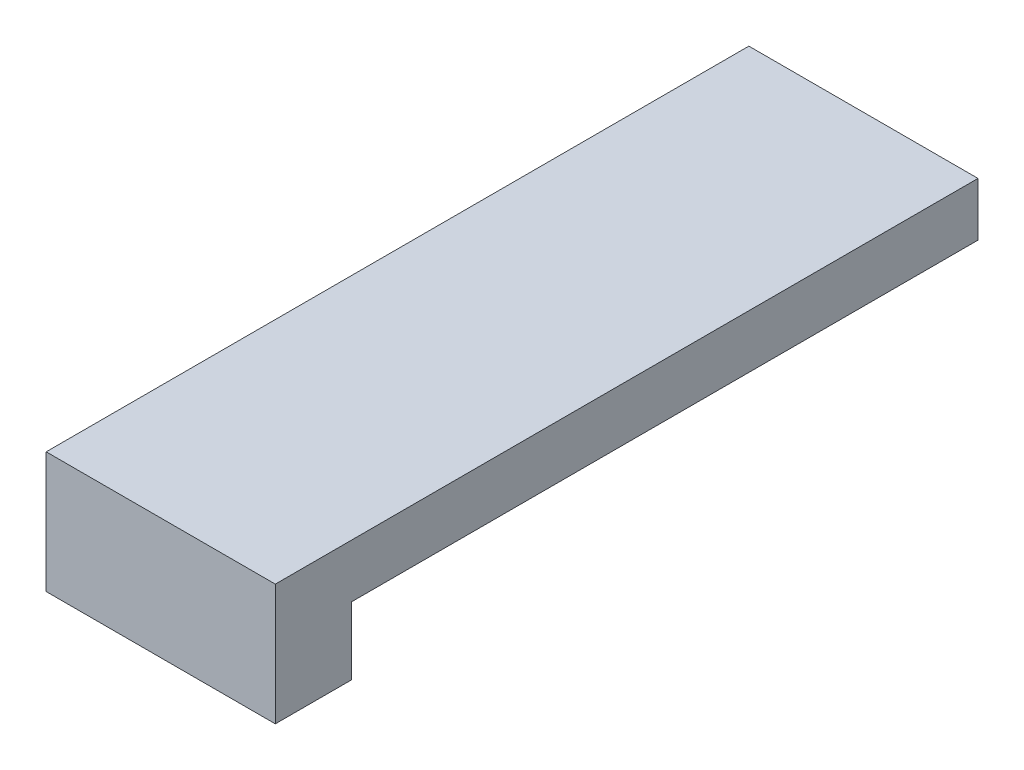
ISO-10303-21;
HEADER;
FILE_DESCRIPTION(('STEP AP214'),'2;1');
FILE_NAME('part.step','',(''),(''),'','','');
FILE_SCHEMA(('AUTOMOTIVE_DESIGN { 1 0 10303 214 1 1 1 1 }'));
ENDSEC;
DATA;
#1=APPLICATION_CONTEXT('core data for automotive mechanical design processes');
#2=APPLICATION_PROTOCOL_DEFINITION('international standard','automotive_design',2000,#1);
#3=PRODUCT_CONTEXT('',#1,'mechanical');
#4=PRODUCT('Part','Part','',(#3));
#5=PRODUCT_RELATED_PRODUCT_CATEGORY('part','',(#4));
#6=PRODUCT_DEFINITION_FORMATION('','',#4);
#7=PRODUCT_DEFINITION_CONTEXT('part definition',#1,'design');
#8=PRODUCT_DEFINITION('design','',#6,#7);
#9=PRODUCT_DEFINITION_SHAPE('','',#8);
#10=(LENGTH_UNIT() NAMED_UNIT(*) SI_UNIT(.MILLI.,.METRE.));
#11=(NAMED_UNIT(*) PLANE_ANGLE_UNIT() SI_UNIT($,.RADIAN.));
#12=(NAMED_UNIT(*) SI_UNIT($,.STERADIAN.) SOLID_ANGLE_UNIT());
#13=UNCERTAINTY_MEASURE_WITH_UNIT(LENGTH_MEASURE(1.E-05),#10,'distance_accuracy_value','');
#14=(GEOMETRIC_REPRESENTATION_CONTEXT(3) GLOBAL_UNCERTAINTY_ASSIGNED_CONTEXT((#13)) GLOBAL_UNIT_ASSIGNED_CONTEXT((#10,
#11,#12)) REPRESENTATION_CONTEXT('',''));
#15=CARTESIAN_POINT('',(0.,0.,0.));
#16=DIRECTION('',(0.,0.,1.));
#17=DIRECTION('',(1.,0.,0.));
#18=AXIS2_PLACEMENT_3D('',#15,#16,#17);
#19=CARTESIAN_POINT('',(-31.0895623366846,21.553225109489,41.));
#20=DIRECTION('',(1.,0.,0.));
#21=DIRECTION('',(0.,0.,-1.));
#22=AXIS2_PLACEMENT_3D('',#19,#20,#21);
#23=PLANE('',#22);
#24=DIRECTION('',(0.,-1.,0.));
#25=VECTOR('',#24,1.);
#26=CARTESIAN_POINT('',(-31.0895623366846,21.553225109489,0.));
#27=LINE('',#26,#25);
#28=CARTESIAN_POINT('',(-31.0895623366846,25.053225109489,0.));
#29=VERTEX_POINT('',#28);
#30=CARTESIAN_POINT('',(-31.0895623366846,21.553225109489,0.));
#31=VERTEX_POINT('',#30);
#32=EDGE_CURVE('E84',#29,#31,#27,.T.);
#33=ORIENTED_EDGE('',*,*,#32,.T.);
#34=DIRECTION('',(0.,0.,-1.));
#35=VECTOR('',#34,1.);
#36=CARTESIAN_POINT('',(-31.0895623366846,21.553225109489,41.));
#37=LINE('',#36,#35);
#38=CARTESIAN_POINT('',(-31.0895623366846,21.553225109489,41.));
#39=VERTEX_POINT('',#38);
#40=EDGE_CURVE('E11',#39,#31,#37,.T.);
#41=ORIENTED_EDGE('',*,*,#40,.F.);
#42=DIRECTION('',(0.,-1.,0.));
#43=VECTOR('',#42,1.);
#44=CARTESIAN_POINT('',(-31.0895623366846,21.553225109489,41.));
#45=LINE('',#44,#43);
#46=CARTESIAN_POINT('',(-31.0895623366846,25.053225109489,41.));
#47=VERTEX_POINT('',#46);
#48=EDGE_CURVE('E79',#47,#39,#45,.T.);
#49=ORIENTED_EDGE('',*,*,#48,.F.);
#50=DIRECTION('',(0.,0.,-1.));
#51=VECTOR('',#50,1.);
#52=CARTESIAN_POINT('',(-31.0895623366846,25.053225109489,41.));
#53=LINE('',#52,#51);
#54=EDGE_CURVE('E52',#47,#29,#53,.T.);
#55=ORIENTED_EDGE('',*,*,#54,.T.);
#56=EDGE_LOOP('',(#33,#41,#49,#55));
#57=FACE_BOUND('',#56,.T.);
#58=ADVANCED_FACE('F33',(#57),#23,.F.);
#59=CARTESIAN_POINT('',(-16.0895623366846,21.553225109489,41.));
#60=DIRECTION('',(0.,1.,0.));
#61=DIRECTION('',(0.,0.,1.));
#62=AXIS2_PLACEMENT_3D('',#59,#60,#61);
#63=PLANE('',#62);
#64=DIRECTION('',(1.,0.,0.));
#65=VECTOR('',#64,1.);
#66=CARTESIAN_POINT('',(-16.0895623366846,21.553225109489,0.));
#67=LINE('',#66,#65);
#68=CARTESIAN_POINT('',(-16.0895623366846,21.553225109489,0.));
#69=VERTEX_POINT('',#68);
#70=EDGE_CURVE('E89',#31,#69,#67,.T.);
#71=ORIENTED_EDGE('',*,*,#70,.T.);
#72=DIRECTION('',(0.,0.,-1.));
#73=VECTOR('',#72,1.);
#74=CARTESIAN_POINT('',(-16.0895623366846,21.553225109489,41.));
#75=LINE('',#74,#73);
#76=CARTESIAN_POINT('',(-16.0895623366846,21.553225109489,41.));
#77=VERTEX_POINT('',#76);
#78=EDGE_CURVE('E43',#77,#69,#75,.T.);
#79=ORIENTED_EDGE('',*,*,#78,.F.);
#80=DIRECTION('',(1.,0.,0.));
#81=VECTOR('',#80,1.);
#82=CARTESIAN_POINT('',(-16.0895623366846,21.553225109489,41.));
#83=LINE('',#82,#81);
#84=EDGE_CURVE('E36',#39,#77,#83,.T.);
#85=ORIENTED_EDGE('',*,*,#84,.F.);
#86=ORIENTED_EDGE('',*,*,#40,.T.);
#87=EDGE_LOOP('',(#71,#79,#85,#86));
#88=FACE_BOUND('',#87,.T.);
#89=ADVANCED_FACE('F109',(#88),#63,.F.);
#90=CARTESIAN_POINT('',(-16.0895623366846,25.053225109489,41.));
#91=DIRECTION('',(-1.,0.,0.));
#92=DIRECTION('',(0.,0.,1.));
#93=AXIS2_PLACEMENT_3D('',#90,#91,#92);
#94=PLANE('',#93);
#95=DIRECTION('',(0.,1.,0.));
#96=VECTOR('',#95,1.);
#97=CARTESIAN_POINT('',(-16.0895623366846,25.053225109489,0.));
#98=LINE('',#97,#96);
#99=CARTESIAN_POINT('',(-16.0895623366846,25.053225109489,0.));
#100=VERTEX_POINT('',#99);
#101=EDGE_CURVE('E70',#69,#100,#98,.T.);
#102=ORIENTED_EDGE('',*,*,#101,.T.);
#103=DIRECTION('',(0.,0.,-1.));
#104=VECTOR('',#103,1.);
#105=CARTESIAN_POINT('',(-16.0895623366846,25.053225109489,41.));
#106=LINE('',#105,#104);
#107=CARTESIAN_POINT('',(-16.0895623366846,25.053225109489,46.));
#108=VERTEX_POINT('',#107);
#109=EDGE_CURVE('E76',#108,#100,#106,.T.);
#110=ORIENTED_EDGE('',*,*,#109,.F.);
#111=DIRECTION('',(0.,1.,0.));
#112=VECTOR('',#111,1.);
#113=CARTESIAN_POINT('',(-16.0895623366846,25.053225109489,46.));
#114=LINE('',#113,#112);
#115=CARTESIAN_POINT('',(-16.0895623366846,17.1290364302439,46.));
#116=VERTEX_POINT('',#115);
#117=EDGE_CURVE('E154',#116,#108,#114,.T.);
#118=ORIENTED_EDGE('',*,*,#117,.F.);
#119=DIRECTION('',(0.,0.,-1.));
#120=VECTOR('',#119,1.);
#121=CARTESIAN_POINT('',(-16.0895623366846,17.1290364302439,46.));
#122=LINE('',#121,#120);
#123=CARTESIAN_POINT('',(-16.0895623366846,17.1290364302439,41.));
#124=VERTEX_POINT('',#123);
#125=EDGE_CURVE('E90',#116,#124,#122,.T.);
#126=ORIENTED_EDGE('',*,*,#125,.T.);
#127=DIRECTION('',(0.,1.,0.));
#128=VECTOR('',#127,1.);
#129=CARTESIAN_POINT('',(-16.0895623366846,25.053225109489,41.));
#130=LINE('',#129,#128);
#131=EDGE_CURVE('E106',#124,#77,#130,.T.);
#132=ORIENTED_EDGE('',*,*,#131,.T.);
#133=ORIENTED_EDGE('',*,*,#78,.T.);
#134=EDGE_LOOP('',(#102,#110,#118,#126,#132,#133));
#135=FACE_BOUND('',#134,.T.);
#136=ADVANCED_FACE('F104',(#135),#94,.F.);
#137=CARTESIAN_POINT('',(-31.0895623366846,25.053225109489,41.));
#138=DIRECTION('',(0.,-1.,0.));
#139=DIRECTION('',(0.,0.,-1.));
#140=AXIS2_PLACEMENT_3D('',#137,#138,#139);
#141=PLANE('',#140);
#142=DIRECTION('',(-1.,0.,0.));
#143=VECTOR('',#142,1.);
#144=CARTESIAN_POINT('',(-31.0895623366846,25.053225109489,0.));
#145=LINE('',#144,#143);
#146=EDGE_CURVE('E73',#100,#29,#145,.T.);
#147=ORIENTED_EDGE('',*,*,#146,.T.);
#148=ORIENTED_EDGE('',*,*,#54,.F.);
#149=DIRECTION('',(0.,0.,-1.));
#150=VECTOR('',#149,1.);
#151=CARTESIAN_POINT('',(-31.0895623366846,25.053225109489,46.));
#152=LINE('',#151,#150);
#153=CARTESIAN_POINT('',(-31.0895623366846,25.053225109489,46.));
#154=VERTEX_POINT('',#153);
#155=EDGE_CURVE('E94',#154,#47,#152,.T.);
#156=ORIENTED_EDGE('',*,*,#155,.F.);
#157=DIRECTION('',(-1.,0.,0.));
#158=VECTOR('',#157,1.);
#159=CARTESIAN_POINT('',(-16.0895623366846,25.053225109489,46.));
#160=LINE('',#159,#158);
#161=EDGE_CURVE('E157',#108,#154,#160,.T.);
#162=ORIENTED_EDGE('',*,*,#161,.F.);
#163=ORIENTED_EDGE('',*,*,#109,.T.);
#164=EDGE_LOOP('',(#147,#148,#156,#162,#163));
#165=FACE_BOUND('',#164,.T.);
#166=ADVANCED_FACE('F74',(#165),#141,.F.);
#167=CARTESIAN_POINT('',(0.,0.,0.));
#168=DIRECTION('',(0.,0.,-1.));
#169=DIRECTION('',(-1.,0.,0.));
#170=AXIS2_PLACEMENT_3D('',#167,#168,#169);
#171=PLANE('',#170);
#172=ORIENTED_EDGE('',*,*,#32,.F.);
#173=ORIENTED_EDGE('',*,*,#146,.F.);
#174=ORIENTED_EDGE('',*,*,#101,.F.);
#175=ORIENTED_EDGE('',*,*,#70,.F.);
#176=EDGE_LOOP('',(#172,#173,#174,#175));
#177=FACE_BOUND('',#176,.T.);
#178=ADVANCED_FACE('F88',(#177),#171,.T.);
#179=CARTESIAN_POINT('',(0.,0.,41.));
#180=DIRECTION('',(0.,0.,1.));
#181=DIRECTION('',(1.,0.,0.));
#182=AXIS2_PLACEMENT_3D('',#179,#180,#181);
#183=PLANE('',#182);
#184=DIRECTION('',(-0.00150291985640459,-0.999998870615315,0.));
#185=VECTOR('',#184,1.);
#186=CARTESIAN_POINT('',(-31.0895623366846,25.053225109489,41.));
#187=LINE('',#186,#185);
#188=CARTESIAN_POINT('',(-31.1014717706468,17.1290364302439,41.));
#189=VERTEX_POINT('',#188);
#190=EDGE_CURVE('E118',#47,#189,#187,.T.);
#191=ORIENTED_EDGE('',*,*,#190,.F.);
#192=ORIENTED_EDGE('',*,*,#48,.T.);
#193=ORIENTED_EDGE('',*,*,#84,.T.);
#194=ORIENTED_EDGE('',*,*,#131,.F.);
#195=DIRECTION('',(1.,0.,0.));
#196=VECTOR('',#195,1.);
#197=CARTESIAN_POINT('',(-16.0895623366846,17.1290364302439,41.));
#198=LINE('',#197,#196);
#199=EDGE_CURVE('E119',#189,#124,#198,.T.);
#200=ORIENTED_EDGE('',*,*,#199,.F.);
#201=EDGE_LOOP('',(#191,#192,#193,#194,#200));
#202=FACE_BOUND('',#201,.T.);
#203=ADVANCED_FACE('F113',(#202),#183,.F.);
#204=CARTESIAN_POINT('',(-16.0895623366846,17.1290364302439,46.));
#205=DIRECTION('',(0.,1.,0.));
#206=DIRECTION('',(0.,0.,1.));
#207=AXIS2_PLACEMENT_3D('',#204,#205,#206);
#208=PLANE('',#207);
#209=ORIENTED_EDGE('',*,*,#199,.T.);
#210=ORIENTED_EDGE('',*,*,#125,.F.);
#211=DIRECTION('',(1.,0.,0.));
#212=VECTOR('',#211,1.);
#213=CARTESIAN_POINT('',(-16.0895623366846,17.1290364302439,46.));
#214=LINE('',#213,#212);
#215=CARTESIAN_POINT('',(-31.1014717706468,17.1290364302439,46.));
#216=VERTEX_POINT('',#215);
#217=EDGE_CURVE('E127',#216,#116,#214,.T.);
#218=ORIENTED_EDGE('',*,*,#217,.F.);
#219=DIRECTION('',(0.,0.,-1.));
#220=VECTOR('',#219,1.);
#221=CARTESIAN_POINT('',(-31.1014717706468,17.1290364302439,46.));
#222=LINE('',#221,#220);
#223=EDGE_CURVE('E128',#216,#189,#222,.T.);
#224=ORIENTED_EDGE('',*,*,#223,.T.);
#225=EDGE_LOOP('',(#209,#210,#218,#224));
#226=FACE_BOUND('',#225,.T.);
#227=ADVANCED_FACE('F143',(#226),#208,.F.);
#228=CARTESIAN_POINT('',(-31.0895623366846,25.053225109489,46.));
#229=DIRECTION('',(0.999998870615315,-0.0015029198564046,0.));
#230=DIRECTION('',(0.0015029198564046,0.999998870615315,0.));
#231=AXIS2_PLACEMENT_3D('',#228,#229,#230);
#232=PLANE('',#231);
#233=ORIENTED_EDGE('',*,*,#190,.T.);
#234=ORIENTED_EDGE('',*,*,#223,.F.);
#235=DIRECTION('',(-0.00150291985640459,-0.999998870615315,0.));
#236=VECTOR('',#235,1.);
#237=CARTESIAN_POINT('',(-31.0895623366846,25.053225109489,46.));
#238=LINE('',#237,#236);
#239=EDGE_CURVE('E130',#154,#216,#238,.T.);
#240=ORIENTED_EDGE('',*,*,#239,.F.);
#241=ORIENTED_EDGE('',*,*,#155,.T.);
#242=EDGE_LOOP('',(#233,#234,#240,#241));
#243=FACE_BOUND('',#242,.T.);
#244=ADVANCED_FACE('F133',(#243),#232,.F.);
#245=CARTESIAN_POINT('',(0.,0.,46.));
#246=DIRECTION('',(0.,0.,1.));
#247=DIRECTION('',(1.,0.,0.));
#248=AXIS2_PLACEMENT_3D('',#245,#246,#247);
#249=PLANE('',#248);
#250=ORIENTED_EDGE('',*,*,#217,.T.);
#251=ORIENTED_EDGE('',*,*,#117,.T.);
#252=ORIENTED_EDGE('',*,*,#161,.T.);
#253=ORIENTED_EDGE('',*,*,#239,.T.);
#254=EDGE_LOOP('',(#250,#251,#252,#253));
#255=FACE_BOUND('',#254,.T.);
#256=ADVANCED_FACE('F159',(#255),#249,.T.);
#257=CLOSED_SHELL('',(#58,#89,#136,#166,#178,#203,#227,#244,#256));
#258=MANIFOLD_SOLID_BREP('B2',#257);
#259=ADVANCED_BREP_SHAPE_REPRESENTATION('',(#18,#258),#14);
#260=SHAPE_DEFINITION_REPRESENTATION(#9,#259);
ENDSEC;
END-ISO-10303-21;
